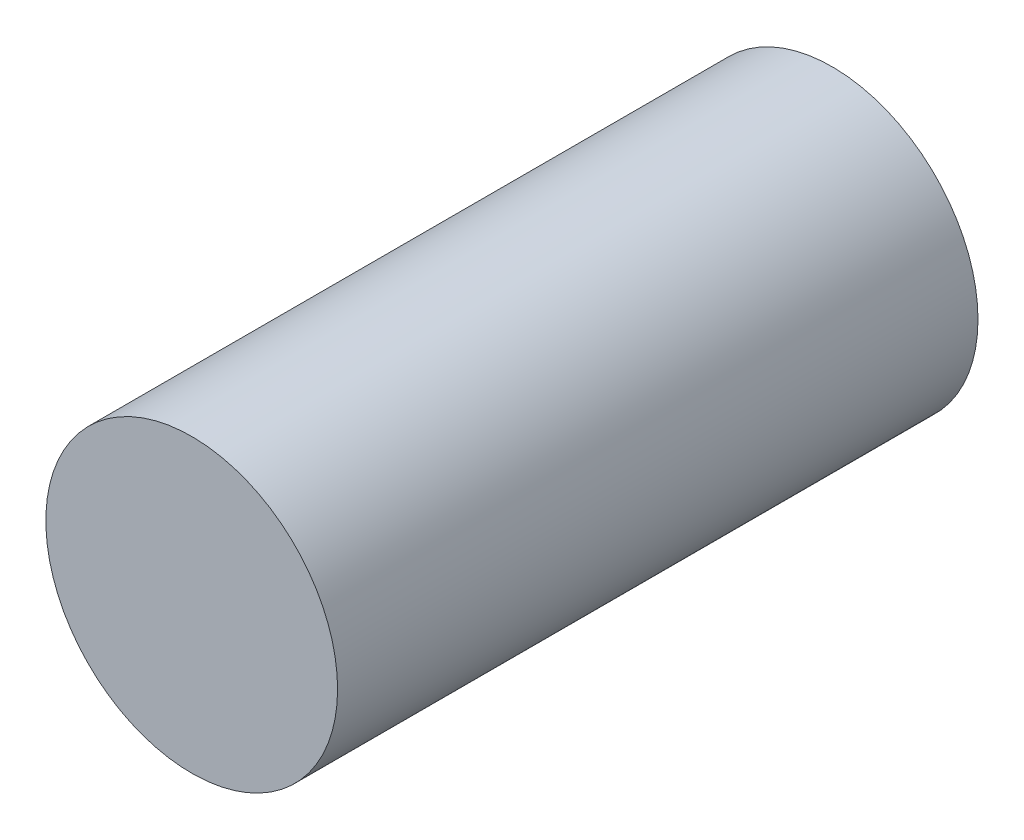
ISO-10303-21;
HEADER;
FILE_DESCRIPTION(('STEP AP214'),'2;1');
FILE_NAME('part.step','',(''),(''),'','','');
FILE_SCHEMA(('AUTOMOTIVE_DESIGN { 1 0 10303 214 1 1 1 1 }'));
ENDSEC;
DATA;
#1=APPLICATION_CONTEXT('core data for automotive mechanical design processes');
#2=APPLICATION_PROTOCOL_DEFINITION('international standard','automotive_design',2000,#1);
#3=PRODUCT_CONTEXT('',#1,'mechanical');
#4=PRODUCT('Part','Part','',(#3));
#5=PRODUCT_RELATED_PRODUCT_CATEGORY('part','',(#4));
#6=PRODUCT_DEFINITION_FORMATION('','',#4);
#7=PRODUCT_DEFINITION_CONTEXT('part definition',#1,'design');
#8=PRODUCT_DEFINITION('design','',#6,#7);
#9=PRODUCT_DEFINITION_SHAPE('','',#8);
#10=(LENGTH_UNIT() NAMED_UNIT(*) SI_UNIT(.MILLI.,.METRE.));
#11=(NAMED_UNIT(*) PLANE_ANGLE_UNIT() SI_UNIT($,.RADIAN.));
#12=(NAMED_UNIT(*) SI_UNIT($,.STERADIAN.) SOLID_ANGLE_UNIT());
#13=UNCERTAINTY_MEASURE_WITH_UNIT(LENGTH_MEASURE(1.E-05),#10,'distance_accuracy_value','');
#14=(GEOMETRIC_REPRESENTATION_CONTEXT(3) GLOBAL_UNCERTAINTY_ASSIGNED_CONTEXT((#13)) GLOBAL_UNIT_ASSIGNED_CONTEXT((#10,
#11,#12)) REPRESENTATION_CONTEXT('',''));
#15=CARTESIAN_POINT('',(0.,0.,0.));
#16=DIRECTION('',(0.,0.,1.));
#17=DIRECTION('',(1.,0.,0.));
#18=AXIS2_PLACEMENT_3D('',#15,#16,#17);
#19=CARTESIAN_POINT('',(-7.62,-1.27,0.1));
#20=DIRECTION('',(0.,0.,1.));
#21=DIRECTION('',(1.,0.,0.));
#22=AXIS2_PLACEMENT_3D('',#19,#20,#21);
#23=PLANE('',#22);
#24=CARTESIAN_POINT('',(-7.62,-1.27,0.1));
#25=DIRECTION('',(0.,0.,1.));
#26=DIRECTION('',(1.,0.,0.));
#27=AXIS2_PLACEMENT_3D('',#24,#25,#26);
#28=CIRCLE('',#27,0.41);
#29=CARTESIAN_POINT('',(-7.21,-1.27,0.1));
#30=VERTEX_POINT('',#29);
#31=EDGE_CURVE('E17',#30,#30,#28,.F.);
#32=ORIENTED_EDGE('',*,*,#31,.F.);
#33=EDGE_LOOP('',(#32));
#34=FACE_BOUND('',#33,.T.);
#35=ADVANCED_FACE('F14',(#34),#23,.T.);
#36=CARTESIAN_POINT('',(-7.62,-1.27,-1.7));
#37=DIRECTION('',(0.,0.,1.));
#38=DIRECTION('',(1.,0.,0.));
#39=AXIS2_PLACEMENT_3D('',#36,#37,#38);
#40=PLANE('',#39);
#41=CARTESIAN_POINT('',(-7.62,-1.27,-1.7));
#42=DIRECTION('',(0.,0.,1.));
#43=DIRECTION('',(1.,0.,0.));
#44=AXIS2_PLACEMENT_3D('',#41,#42,#43);
#45=CIRCLE('',#44,0.41);
#46=CARTESIAN_POINT('',(-7.21,-1.27,-1.7));
#47=VERTEX_POINT('',#46);
#48=EDGE_CURVE('E10',#47,#47,#45,.T.);
#49=ORIENTED_EDGE('',*,*,#48,.F.);
#50=EDGE_LOOP('',(#49));
#51=FACE_BOUND('',#50,.T.);
#52=ADVANCED_FACE('F29',(#51),#40,.F.);
#53=CARTESIAN_POINT('',(-7.62,-1.27,-1.7));
#54=DIRECTION('',(0.,0.,1.));
#55=DIRECTION('',(1.,0.,0.));
#56=AXIS2_PLACEMENT_3D('',#53,#54,#55);
#57=CYLINDRICAL_SURFACE('',#56,0.41);
#58=ORIENTED_EDGE('',*,*,#48,.T.);
#59=EDGE_LOOP('',(#58));
#60=FACE_BOUND('',#59,.T.);
#61=ORIENTED_EDGE('',*,*,#31,.T.);
#62=EDGE_LOOP('',(#61));
#63=FACE_BOUND('',#62,.T.);
#64=ADVANCED_FACE('F26',(#60,#63),#57,.T.);
#65=CLOSED_SHELL('',(#35,#52,#64));
#66=MANIFOLD_SOLID_BREP('B1',#65);
#67=ADVANCED_BREP_SHAPE_REPRESENTATION('',(#18,#66),#14);
#68=SHAPE_DEFINITION_REPRESENTATION(#9,#67);
ENDSEC;
END-ISO-10303-21;
